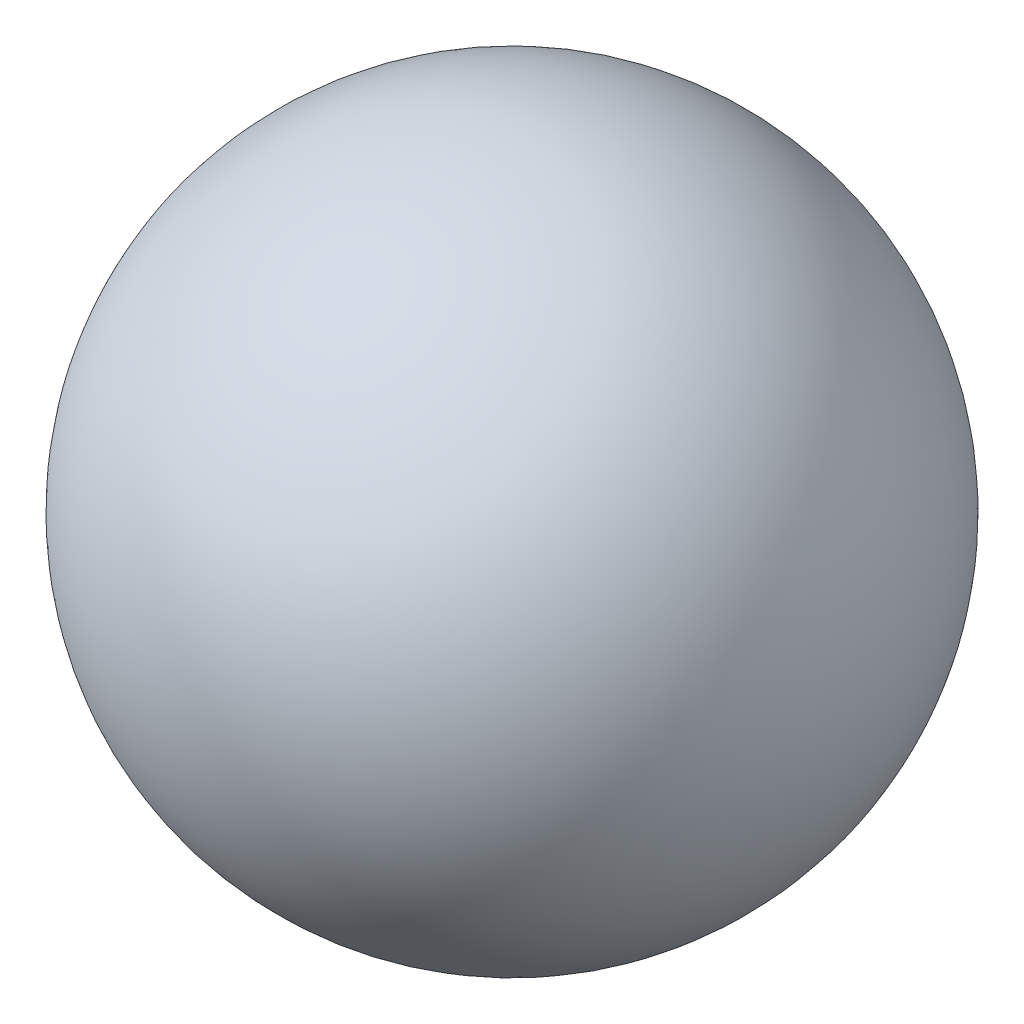
ISO-10303-21;
HEADER;
FILE_DESCRIPTION(('STEP AP214'),'2;1');
FILE_NAME('part.step','',(''),(''),'','','');
FILE_SCHEMA(('AUTOMOTIVE_DESIGN { 1 0 10303 214 1 1 1 1 }'));
ENDSEC;
DATA;
#1=APPLICATION_CONTEXT('core data for automotive mechanical design processes');
#2=APPLICATION_PROTOCOL_DEFINITION('international standard','automotive_design',2000,#1);
#3=PRODUCT_CONTEXT('',#1,'mechanical');
#4=PRODUCT('Part','Part','',(#3));
#5=PRODUCT_RELATED_PRODUCT_CATEGORY('part','',(#4));
#6=PRODUCT_DEFINITION_FORMATION('','',#4);
#7=PRODUCT_DEFINITION_CONTEXT('part definition',#1,'design');
#8=PRODUCT_DEFINITION('design','',#6,#7);
#9=PRODUCT_DEFINITION_SHAPE('','',#8);
#10=(LENGTH_UNIT() NAMED_UNIT(*) SI_UNIT(.MILLI.,.METRE.));
#11=(NAMED_UNIT(*) PLANE_ANGLE_UNIT() SI_UNIT($,.RADIAN.));
#12=(NAMED_UNIT(*) SI_UNIT($,.STERADIAN.) SOLID_ANGLE_UNIT());
#13=UNCERTAINTY_MEASURE_WITH_UNIT(LENGTH_MEASURE(1.E-05),#10,'distance_accuracy_value','');
#14=(GEOMETRIC_REPRESENTATION_CONTEXT(3) GLOBAL_UNCERTAINTY_ASSIGNED_CONTEXT((#13)) GLOBAL_UNIT_ASSIGNED_CONTEXT((#10,
#11,#12)) REPRESENTATION_CONTEXT('',''));
#15=CARTESIAN_POINT('',(0.,0.,0.));
#16=DIRECTION('',(0.,0.,1.));
#17=DIRECTION('',(1.,0.,0.));
#18=AXIS2_PLACEMENT_3D('',#15,#16,#17);
#19=CARTESIAN_POINT('',(-0.0944881859763803,0.,0.));
#20=DIRECTION('',(-1.,0.,0.));
#21=DIRECTION('',(0.,0.,-1.));
#22=AXIS2_PLACEMENT_3D('',#19,#20,#21);
#23=SPHERICAL_SURFACE('',#22,12.000000003);
#24=CARTESIAN_POINT('',(-12.0944881889764,0.,0.));
#25=VERTEX_POINT('',#24);
#26=VERTEX_LOOP('',#25);
#27=FACE_BOUND('',#26,.T.);
#28=ADVANCED_FACE('F31',(#27),#23,.T.);
#29=CLOSED_SHELL('',(#28));
#30=MANIFOLD_SOLID_BREP('B2',#29);
#31=ADVANCED_BREP_SHAPE_REPRESENTATION('',(#18,#30),#14);
#32=SHAPE_DEFINITION_REPRESENTATION(#9,#31);
ENDSEC;
END-ISO-10303-21;
